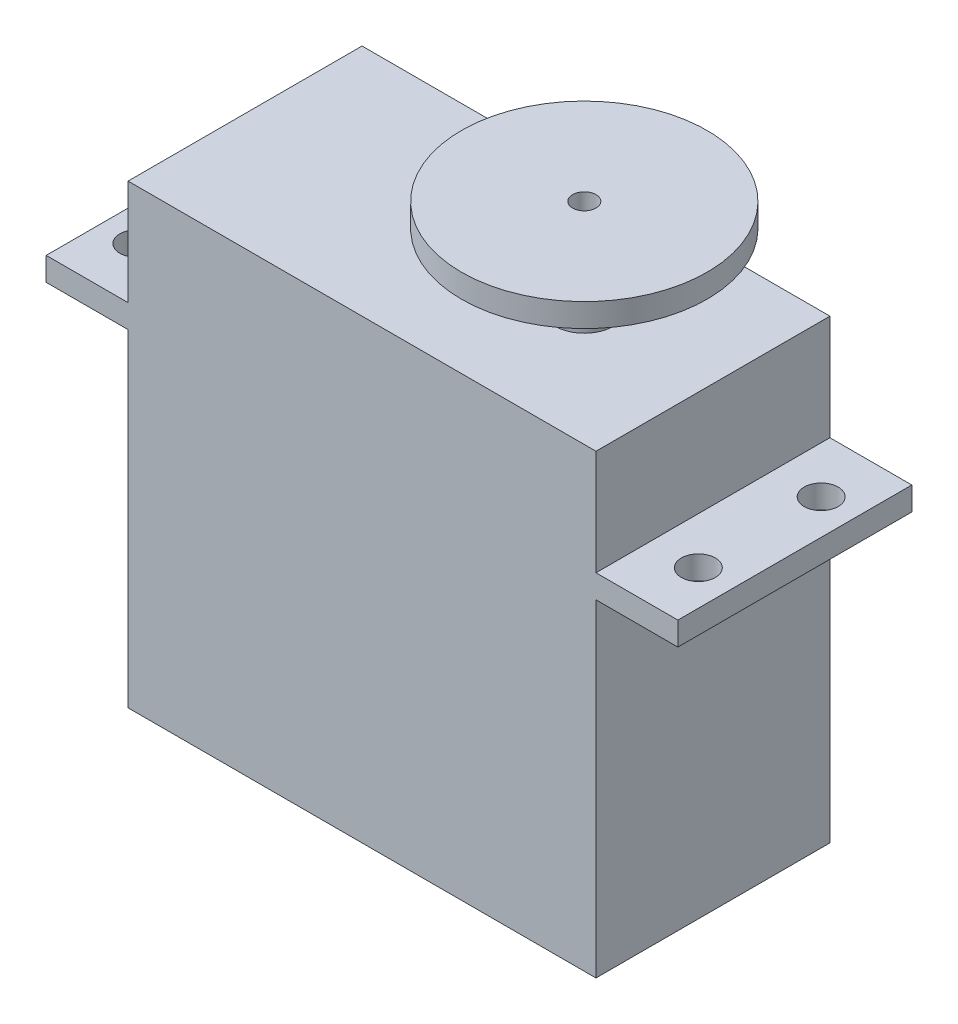
ISO-10303-21;
HEADER;
FILE_DESCRIPTION(('STEP AP214'),'2;1');
FILE_NAME('part.step','',(''),(''),'','','');
FILE_SCHEMA(('AUTOMOTIVE_DESIGN { 1 0 10303 214 1 1 1 1 }'));
ENDSEC;
DATA;
#1=APPLICATION_CONTEXT('core data for automotive mechanical design processes');
#2=APPLICATION_PROTOCOL_DEFINITION('international standard','automotive_design',2000,#1);
#3=PRODUCT_CONTEXT('',#1,'mechanical');
#4=PRODUCT('Part','Part','',(#3));
#5=PRODUCT_RELATED_PRODUCT_CATEGORY('part','',(#4));
#6=PRODUCT_DEFINITION_FORMATION('','',#4);
#7=PRODUCT_DEFINITION_CONTEXT('part definition',#1,'design');
#8=PRODUCT_DEFINITION('design','',#6,#7);
#9=PRODUCT_DEFINITION_SHAPE('','',#8);
#10=(LENGTH_UNIT() NAMED_UNIT(*) SI_UNIT(.MILLI.,.METRE.));
#11=(NAMED_UNIT(*) PLANE_ANGLE_UNIT() SI_UNIT($,.RADIAN.));
#12=(NAMED_UNIT(*) SI_UNIT($,.STERADIAN.) SOLID_ANGLE_UNIT());
#13=UNCERTAINTY_MEASURE_WITH_UNIT(LENGTH_MEASURE(1.E-05),#10,'distance_accuracy_value','');
#14=(GEOMETRIC_REPRESENTATION_CONTEXT(3) GLOBAL_UNCERTAINTY_ASSIGNED_CONTEXT((#13)) GLOBAL_UNIT_ASSIGNED_CONTEXT((#10,
#11,#12)) REPRESENTATION_CONTEXT('',''));
#15=CARTESIAN_POINT('',(0.,0.,0.));
#16=DIRECTION('',(0.,0.,1.));
#17=DIRECTION('',(1.,0.,0.));
#18=AXIS2_PLACEMENT_3D('',#15,#16,#17);
#19=CARTESIAN_POINT('',(-20.,39.,10.));
#20=DIRECTION('',(1.,0.,0.));
#21=DIRECTION('',(0.,0.,-1.));
#22=AXIS2_PLACEMENT_3D('',#19,#20,#21);
#23=PLANE('',#22);
#24=DIRECTION('',(0.,0.,-1.));
#25=VECTOR('',#24,1.);
#26=CARTESIAN_POINT('',(-20.,30.,-10.));
#27=LINE('',#26,#25);
#28=CARTESIAN_POINT('',(-20.,30.,10.));
#29=VERTEX_POINT('',#28);
#30=CARTESIAN_POINT('',(-20.,30.,-10.));
#31=VERTEX_POINT('',#30);
#32=EDGE_CURVE('E151',#29,#31,#27,.T.);
#33=ORIENTED_EDGE('',*,*,#32,.F.);
#34=DIRECTION('',(0.,-1.,0.));
#35=VECTOR('',#34,1.);
#36=CARTESIAN_POINT('',(-20.,39.,10.));
#37=LINE('',#36,#35);
#38=CARTESIAN_POINT('',(-20.,39.,10.));
#39=VERTEX_POINT('',#38);
#40=EDGE_CURVE('E233',#39,#29,#37,.T.);
#41=ORIENTED_EDGE('',*,*,#40,.F.);
#42=DIRECTION('',(0.,0.,1.));
#43=VECTOR('',#42,1.);
#44=CARTESIAN_POINT('',(-20.,39.,10.));
#45=LINE('',#44,#43);
#46=CARTESIAN_POINT('',(-20.,39.,-10.));
#47=VERTEX_POINT('',#46);
#48=EDGE_CURVE('E209',#47,#39,#45,.T.);
#49=ORIENTED_EDGE('',*,*,#48,.F.);
#50=DIRECTION('',(0.,-1.,0.));
#51=VECTOR('',#50,1.);
#52=CARTESIAN_POINT('',(-20.,39.,-10.));
#53=LINE('',#52,#51);
#54=EDGE_CURVE('E63',#47,#31,#53,.T.);
#55=ORIENTED_EDGE('',*,*,#54,.T.);
#56=EDGE_LOOP('',(#33,#41,#49,#55));
#57=FACE_BOUND('',#56,.T.);
#58=ADVANCED_FACE('F39',(#57),#23,.F.);
#59=DIRECTION('',(0.,0.,1.));
#60=VECTOR('',#59,1.);
#61=CARTESIAN_POINT('',(-20.,28.,-10.));
#62=LINE('',#61,#60);
#63=CARTESIAN_POINT('',(-20.,28.,-10.));
#64=VERTEX_POINT('',#63);
#65=CARTESIAN_POINT('',(-20.,28.,10.));
#66=VERTEX_POINT('',#65);
#67=EDGE_CURVE('E55',#64,#66,#62,.T.);
#68=ORIENTED_EDGE('',*,*,#67,.F.);
#69=CARTESIAN_POINT('',(-20.,0.,-10.));
#70=VERTEX_POINT('',#69);
#71=EDGE_CURVE('E155',#64,#70,#53,.T.);
#72=ORIENTED_EDGE('',*,*,#71,.T.);
#73=DIRECTION('',(0.,0.,1.));
#74=VECTOR('',#73,1.);
#75=CARTESIAN_POINT('',(-20.,0.,10.));
#76=LINE('',#75,#74);
#77=CARTESIAN_POINT('',(-20.,0.,10.));
#78=VERTEX_POINT('',#77);
#79=EDGE_CURVE('E222',#70,#78,#76,.T.);
#80=ORIENTED_EDGE('',*,*,#79,.T.);
#81=EDGE_CURVE('E232',#66,#78,#37,.T.);
#82=ORIENTED_EDGE('',*,*,#81,.F.);
#83=EDGE_LOOP('',(#68,#72,#80,#82));
#84=FACE_BOUND('',#83,.T.);
#85=ADVANCED_FACE('F260',(#84),#23,.F.);
#86=CARTESIAN_POINT('',(20.,39.,10.));
#87=DIRECTION('',(-1.,0.,0.));
#88=DIRECTION('',(0.,0.,1.));
#89=AXIS2_PLACEMENT_3D('',#86,#87,#88);
#90=PLANE('',#89);
#91=DIRECTION('',(0.,0.,1.));
#92=VECTOR('',#91,1.);
#93=CARTESIAN_POINT('',(20.,30.,10.));
#94=LINE('',#93,#92);
#95=CARTESIAN_POINT('',(20.,30.,-10.));
#96=VERTEX_POINT('',#95);
#97=CARTESIAN_POINT('',(20.,30.,10.));
#98=VERTEX_POINT('',#97);
#99=EDGE_CURVE('E162',#96,#98,#94,.T.);
#100=ORIENTED_EDGE('',*,*,#99,.F.);
#101=DIRECTION('',(0.,-1.,0.));
#102=VECTOR('',#101,1.);
#103=CARTESIAN_POINT('',(20.,39.,-10.));
#104=LINE('',#103,#102);
#105=CARTESIAN_POINT('',(20.,39.,-10.));
#106=VERTEX_POINT('',#105);
#107=EDGE_CURVE('E48',#106,#96,#104,.T.);
#108=ORIENTED_EDGE('',*,*,#107,.F.);
#109=DIRECTION('',(0.,0.,-1.));
#110=VECTOR('',#109,1.);
#111=CARTESIAN_POINT('',(20.,39.,10.));
#112=LINE('',#111,#110);
#113=CARTESIAN_POINT('',(20.,39.,10.));
#114=VERTEX_POINT('',#113);
#115=EDGE_CURVE('E201',#114,#106,#112,.T.);
#116=ORIENTED_EDGE('',*,*,#115,.F.);
#117=DIRECTION('',(0.,-1.,0.));
#118=VECTOR('',#117,1.);
#119=CARTESIAN_POINT('',(20.,39.,10.));
#120=LINE('',#119,#118);
#121=EDGE_CURVE('E229',#114,#98,#120,.T.);
#122=ORIENTED_EDGE('',*,*,#121,.T.);
#123=EDGE_LOOP('',(#100,#108,#116,#122));
#124=FACE_BOUND('',#123,.T.);
#125=ADVANCED_FACE('F41',(#124),#90,.F.);
#126=DIRECTION('',(0.,0.,-1.));
#127=VECTOR('',#126,1.);
#128=CARTESIAN_POINT('',(20.,28.,10.));
#129=LINE('',#128,#127);
#130=CARTESIAN_POINT('',(20.,28.,10.));
#131=VERTEX_POINT('',#130);
#132=CARTESIAN_POINT('',(20.,28.,-10.));
#133=VERTEX_POINT('',#132);
#134=EDGE_CURVE('E157',#131,#133,#129,.T.);
#135=ORIENTED_EDGE('',*,*,#134,.F.);
#136=CARTESIAN_POINT('',(20.,0.,10.));
#137=VERTEX_POINT('',#136);
#138=EDGE_CURVE('E215',#131,#137,#120,.T.);
#139=ORIENTED_EDGE('',*,*,#138,.T.);
#140=DIRECTION('',(0.,0.,-1.));
#141=VECTOR('',#140,1.);
#142=CARTESIAN_POINT('',(20.,0.,10.));
#143=LINE('',#142,#141);
#144=CARTESIAN_POINT('',(20.,0.,-10.));
#145=VERTEX_POINT('',#144);
#146=EDGE_CURVE('E200',#137,#145,#143,.T.);
#147=ORIENTED_EDGE('',*,*,#146,.T.);
#148=EDGE_CURVE('E238',#133,#145,#104,.T.);
#149=ORIENTED_EDGE('',*,*,#148,.F.);
#150=EDGE_LOOP('',(#135,#139,#147,#149));
#151=FACE_BOUND('',#150,.T.);
#152=ADVANCED_FACE('F253',(#151),#90,.F.);
#153=CARTESIAN_POINT('',(-20.,39.,-10.));
#154=DIRECTION('',(0.,0.,1.));
#155=DIRECTION('',(1.,0.,0.));
#156=AXIS2_PLACEMENT_3D('',#153,#154,#155);
#157=PLANE('',#156);
#158=DIRECTION('',(-1.,0.,0.));
#159=VECTOR('',#158,1.);
#160=CARTESIAN_POINT('',(-20.,0.,-10.));
#161=LINE('',#160,#159);
#162=EDGE_CURVE('E219',#145,#70,#161,.T.);
#163=ORIENTED_EDGE('',*,*,#162,.T.);
#164=ORIENTED_EDGE('',*,*,#71,.F.);
#165=DIRECTION('',(1.,0.,0.));
#166=VECTOR('',#165,1.);
#167=CARTESIAN_POINT('',(-27.,28.,-10.));
#168=LINE('',#167,#166);
#169=CARTESIAN_POINT('',(-27.,28.,-10.));
#170=VERTEX_POINT('',#169);
#171=EDGE_CURVE('E134',#170,#64,#168,.T.);
#172=ORIENTED_EDGE('',*,*,#171,.F.);
#173=DIRECTION('',(0.,-1.,0.));
#174=VECTOR('',#173,1.);
#175=CARTESIAN_POINT('',(-27.,30.,-10.));
#176=LINE('',#175,#174);
#177=CARTESIAN_POINT('',(-27.,30.,-10.));
#178=VERTEX_POINT('',#177);
#179=EDGE_CURVE('E141',#178,#170,#176,.T.);
#180=ORIENTED_EDGE('',*,*,#179,.F.);
#181=DIRECTION('',(1.,0.,0.));
#182=VECTOR('',#181,1.);
#183=CARTESIAN_POINT('',(-27.,30.,-10.));
#184=LINE('',#183,#182);
#185=EDGE_CURVE('E506',#178,#31,#184,.T.);
#186=ORIENTED_EDGE('',*,*,#185,.T.);
#187=ORIENTED_EDGE('',*,*,#54,.F.);
#188=DIRECTION('',(-1.,0.,0.));
#189=VECTOR('',#188,1.);
#190=CARTESIAN_POINT('',(-20.,39.,-10.));
#191=LINE('',#190,#189);
#192=EDGE_CURVE('E205',#106,#47,#191,.T.);
#193=ORIENTED_EDGE('',*,*,#192,.F.);
#194=ORIENTED_EDGE('',*,*,#107,.T.);
#195=DIRECTION('',(-1.,0.,0.));
#196=VECTOR('',#195,1.);
#197=CARTESIAN_POINT('',(27.,30.,-10.));
#198=LINE('',#197,#196);
#199=CARTESIAN_POINT('',(27.,30.,-10.));
#200=VERTEX_POINT('',#199);
#201=EDGE_CURVE('E188',#200,#96,#198,.T.);
#202=ORIENTED_EDGE('',*,*,#201,.F.);
#203=DIRECTION('',(0.,1.,0.));
#204=VECTOR('',#203,1.);
#205=CARTESIAN_POINT('',(27.,30.,-10.));
#206=LINE('',#205,#204);
#207=CARTESIAN_POINT('',(27.,28.,-10.));
#208=VERTEX_POINT('',#207);
#209=EDGE_CURVE('E175',#208,#200,#206,.T.);
#210=ORIENTED_EDGE('',*,*,#209,.F.);
#211=DIRECTION('',(-1.,0.,0.));
#212=VECTOR('',#211,1.);
#213=CARTESIAN_POINT('',(27.,28.,-10.));
#214=LINE('',#213,#212);
#215=EDGE_CURVE('E192',#208,#133,#214,.T.);
#216=ORIENTED_EDGE('',*,*,#215,.T.);
#217=ORIENTED_EDGE('',*,*,#148,.T.);
#218=EDGE_LOOP('',(#163,#164,#172,#180,#186,#187,#193,#194,#202,#210,#216,#217));
#219=FACE_BOUND('',#218,.T.);
#220=ADVANCED_FACE('F154',(#219),#157,.F.);
#221=CARTESIAN_POINT('',(-20.,39.,10.));
#222=DIRECTION('',(0.,0.,-1.));
#223=DIRECTION('',(-1.,0.,0.));
#224=AXIS2_PLACEMENT_3D('',#221,#222,#223);
#225=PLANE('',#224);
#226=DIRECTION('',(1.,0.,0.));
#227=VECTOR('',#226,1.);
#228=CARTESIAN_POINT('',(-20.,0.,10.));
#229=LINE('',#228,#227);
#230=EDGE_CURVE('E206',#78,#137,#229,.T.);
#231=ORIENTED_EDGE('',*,*,#230,.T.);
#232=ORIENTED_EDGE('',*,*,#138,.F.);
#233=DIRECTION('',(-1.,0.,0.));
#234=VECTOR('',#233,1.);
#235=CARTESIAN_POINT('',(27.,28.,10.));
#236=LINE('',#235,#234);
#237=CARTESIAN_POINT('',(27.,28.,10.));
#238=VERTEX_POINT('',#237);
#239=EDGE_CURVE('E196',#238,#131,#236,.T.);
#240=ORIENTED_EDGE('',*,*,#239,.F.);
#241=DIRECTION('',(0.,-1.,0.));
#242=VECTOR('',#241,1.);
#243=CARTESIAN_POINT('',(27.,30.,10.));
#244=LINE('',#243,#242);
#245=CARTESIAN_POINT('',(27.,30.,10.));
#246=VERTEX_POINT('',#245);
#247=EDGE_CURVE('E168',#246,#238,#244,.T.);
#248=ORIENTED_EDGE('',*,*,#247,.F.);
#249=DIRECTION('',(-1.,0.,0.));
#250=VECTOR('',#249,1.);
#251=CARTESIAN_POINT('',(27.,30.,10.));
#252=LINE('',#251,#250);
#253=EDGE_CURVE('E180',#246,#98,#252,.T.);
#254=ORIENTED_EDGE('',*,*,#253,.T.);
#255=ORIENTED_EDGE('',*,*,#121,.F.);
#256=DIRECTION('',(1.,0.,0.));
#257=VECTOR('',#256,1.);
#258=CARTESIAN_POINT('',(-20.,39.,10.));
#259=LINE('',#258,#257);
#260=EDGE_CURVE('E212',#39,#114,#259,.T.);
#261=ORIENTED_EDGE('',*,*,#260,.F.);
#262=ORIENTED_EDGE('',*,*,#40,.T.);
#263=DIRECTION('',(1.,0.,0.));
#264=VECTOR('',#263,1.);
#265=CARTESIAN_POINT('',(-27.,30.,10.));
#266=LINE('',#265,#264);
#267=CARTESIAN_POINT('',(-27.,30.,10.));
#268=VERTEX_POINT('',#267);
#269=EDGE_CURVE('E164',#268,#29,#266,.T.);
#270=ORIENTED_EDGE('',*,*,#269,.F.);
#271=DIRECTION('',(0.,1.,0.));
#272=VECTOR('',#271,1.);
#273=CARTESIAN_POINT('',(-27.,30.,10.));
#274=LINE('',#273,#272);
#275=CARTESIAN_POINT('',(-27.,28.,10.));
#276=VERTEX_POINT('',#275);
#277=EDGE_CURVE('E140',#276,#268,#274,.T.);
#278=ORIENTED_EDGE('',*,*,#277,.F.);
#279=DIRECTION('',(1.,0.,0.));
#280=VECTOR('',#279,1.);
#281=CARTESIAN_POINT('',(-27.,28.,10.));
#282=LINE('',#281,#280);
#283=EDGE_CURVE('E136',#276,#66,#282,.T.);
#284=ORIENTED_EDGE('',*,*,#283,.T.);
#285=ORIENTED_EDGE('',*,*,#81,.T.);
#286=EDGE_LOOP('',(#231,#232,#240,#248,#254,#255,#261,#262,#270,#278,#284,#285));
#287=FACE_BOUND('',#286,.T.);
#288=ADVANCED_FACE('F258',(#287),#225,.F.);
#289=CARTESIAN_POINT('',(0.,39.,0.));
#290=DIRECTION('',(0.,-1.,0.));
#291=DIRECTION('',(0.,0.,-1.));
#292=AXIS2_PLACEMENT_3D('',#289,#290,#291);
#293=PLANE('',#292);
#294=CARTESIAN_POINT('',(9.00000000000001,39.,0.));
#295=DIRECTION('',(0.,-1.,0.));
#296=DIRECTION('',(0.,0.,-1.));
#297=AXIS2_PLACEMENT_3D('',#294,#295,#296);
#298=CIRCLE('',#297,2.5);
#299=CARTESIAN_POINT('',(9.00000000000001,39.,-2.5));
#300=VERTEX_POINT('',#299);
#301=EDGE_CURVE('E11',#300,#300,#298,.F.);
#302=ORIENTED_EDGE('',*,*,#301,.F.);
#303=EDGE_LOOP('',(#302));
#304=FACE_BOUND('',#303,.T.);
#305=ORIENTED_EDGE('',*,*,#115,.T.);
#306=ORIENTED_EDGE('',*,*,#192,.T.);
#307=ORIENTED_EDGE('',*,*,#48,.T.);
#308=ORIENTED_EDGE('',*,*,#260,.T.);
#309=EDGE_LOOP('',(#305,#306,#307,#308));
#310=FACE_BOUND('',#309,.T.);
#311=ADVANCED_FACE('F276',(#304,#310),#293,.F.);
#312=CARTESIAN_POINT('',(0.,0.,0.));
#313=DIRECTION('',(0.,-1.,0.));
#314=DIRECTION('',(0.,0.,-1.));
#315=AXIS2_PLACEMENT_3D('',#312,#313,#314);
#316=PLANE('',#315);
#317=ORIENTED_EDGE('',*,*,#146,.F.);
#318=ORIENTED_EDGE('',*,*,#230,.F.);
#319=ORIENTED_EDGE('',*,*,#79,.F.);
#320=ORIENTED_EDGE('',*,*,#162,.F.);
#321=EDGE_LOOP('',(#317,#318,#319,#320));
#322=FACE_BOUND('',#321,.T.);
#323=ADVANCED_FACE('F251',(#322),#316,.T.);
#324=CARTESIAN_POINT('',(27.,28.,10.));
#325=DIRECTION('',(0.,1.,0.));
#326=DIRECTION('',(0.,0.,1.));
#327=AXIS2_PLACEMENT_3D('',#324,#325,#326);
#328=PLANE('',#327);
#329=CARTESIAN_POINT('',(24.,28.,5.25));
#330=DIRECTION('',(0.,1.,0.));
#331=DIRECTION('',(0.,0.,1.));
#332=AXIS2_PLACEMENT_3D('',#329,#330,#331);
#333=CIRCLE('',#332,1.45);
#334=CARTESIAN_POINT('',(24.,28.,6.7));
#335=VERTEX_POINT('',#334);
#336=EDGE_CURVE('E514',#335,#335,#333,.T.);
#337=ORIENTED_EDGE('',*,*,#336,.T.);
#338=EDGE_LOOP('',(#337));
#339=FACE_BOUND('',#338,.T.);
#340=CARTESIAN_POINT('',(24.,28.,-5.25));
#341=DIRECTION('',(0.,1.,0.));
#342=DIRECTION('',(0.,0.,1.));
#343=AXIS2_PLACEMENT_3D('',#340,#341,#342);
#344=CIRCLE('',#343,1.45);
#345=CARTESIAN_POINT('',(24.,28.,-3.8));
#346=VERTEX_POINT('',#345);
#347=EDGE_CURVE('E522',#346,#346,#344,.T.);
#348=ORIENTED_EDGE('',*,*,#347,.T.);
#349=EDGE_LOOP('',(#348));
#350=FACE_BOUND('',#349,.T.);
#351=ORIENTED_EDGE('',*,*,#134,.T.);
#352=ORIENTED_EDGE('',*,*,#215,.F.);
#353=DIRECTION('',(0.,0.,-1.));
#354=VECTOR('',#353,1.);
#355=CARTESIAN_POINT('',(27.,28.,10.));
#356=LINE('',#355,#354);
#357=EDGE_CURVE('E172',#238,#208,#356,.T.);
#358=ORIENTED_EDGE('',*,*,#357,.F.);
#359=ORIENTED_EDGE('',*,*,#239,.T.);
#360=EDGE_LOOP('',(#351,#352,#358,#359));
#361=FACE_BOUND('',#360,.T.);
#362=ADVANCED_FACE('F293',(#339,#350,#361),#328,.F.);
#363=CARTESIAN_POINT('',(27.,30.,10.));
#364=DIRECTION('',(0.,-1.,0.));
#365=DIRECTION('',(0.,0.,-1.));
#366=AXIS2_PLACEMENT_3D('',#363,#364,#365);
#367=PLANE('',#366);
#368=CARTESIAN_POINT('',(24.,30.,5.25));
#369=DIRECTION('',(0.,1.,0.));
#370=DIRECTION('',(0.,0.,1.));
#371=AXIS2_PLACEMENT_3D('',#368,#369,#370);
#372=CIRCLE('',#371,1.45);
#373=CARTESIAN_POINT('',(24.,30.,6.7));
#374=VERTEX_POINT('',#373);
#375=EDGE_CURVE('E538',#374,#374,#372,.T.);
#376=ORIENTED_EDGE('',*,*,#375,.F.);
#377=EDGE_LOOP('',(#376));
#378=FACE_BOUND('',#377,.T.);
#379=CARTESIAN_POINT('',(24.,30.,-5.25));
#380=DIRECTION('',(0.,1.,0.));
#381=DIRECTION('',(0.,0.,1.));
#382=AXIS2_PLACEMENT_3D('',#379,#380,#381);
#383=CIRCLE('',#382,1.45);
#384=CARTESIAN_POINT('',(24.,30.,-3.8));
#385=VERTEX_POINT('',#384);
#386=EDGE_CURVE('E534',#385,#385,#383,.T.);
#387=ORIENTED_EDGE('',*,*,#386,.F.);
#388=EDGE_LOOP('',(#387));
#389=FACE_BOUND('',#388,.T.);
#390=ORIENTED_EDGE('',*,*,#99,.T.);
#391=ORIENTED_EDGE('',*,*,#253,.F.);
#392=DIRECTION('',(0.,0.,1.));
#393=VECTOR('',#392,1.);
#394=CARTESIAN_POINT('',(27.,30.,10.));
#395=LINE('',#394,#393);
#396=EDGE_CURVE('E178',#200,#246,#395,.T.);
#397=ORIENTED_EDGE('',*,*,#396,.F.);
#398=ORIENTED_EDGE('',*,*,#201,.T.);
#399=EDGE_LOOP('',(#390,#391,#397,#398));
#400=FACE_BOUND('',#399,.T.);
#401=ADVANCED_FACE('F305',(#378,#389,#400),#367,.F.);
#402=CARTESIAN_POINT('',(27.,0.,0.));
#403=DIRECTION('',(1.,0.,0.));
#404=DIRECTION('',(0.,0.,-1.));
#405=AXIS2_PLACEMENT_3D('',#402,#403,#404);
#406=PLANE('',#405);
#407=ORIENTED_EDGE('',*,*,#247,.T.);
#408=ORIENTED_EDGE('',*,*,#357,.T.);
#409=ORIENTED_EDGE('',*,*,#209,.T.);
#410=ORIENTED_EDGE('',*,*,#396,.T.);
#411=EDGE_LOOP('',(#407,#408,#409,#410));
#412=FACE_BOUND('',#411,.T.);
#413=ADVANCED_FACE('F314',(#412),#406,.T.);
#414=CARTESIAN_POINT('',(-27.,28.,-10.));
#415=DIRECTION('',(0.,1.,0.));
#416=DIRECTION('',(0.,0.,1.));
#417=AXIS2_PLACEMENT_3D('',#414,#415,#416);
#418=PLANE('',#417);
#419=CARTESIAN_POINT('',(-24.,28.,-5.25));
#420=DIRECTION('',(0.,1.,0.));
#421=DIRECTION('',(0.,0.,1.));
#422=AXIS2_PLACEMENT_3D('',#419,#420,#421);
#423=CIRCLE('',#422,1.45);
#424=CARTESIAN_POINT('',(-24.,28.,-3.8));
#425=VERTEX_POINT('',#424);
#426=EDGE_CURVE('E526',#425,#425,#423,.T.);
#427=ORIENTED_EDGE('',*,*,#426,.T.);
#428=EDGE_LOOP('',(#427));
#429=FACE_BOUND('',#428,.T.);
#430=CARTESIAN_POINT('',(-24.,28.,5.25));
#431=DIRECTION('',(0.,1.,0.));
#432=DIRECTION('',(0.,0.,1.));
#433=AXIS2_PLACEMENT_3D('',#430,#431,#432);
#434=CIRCLE('',#433,1.45);
#435=CARTESIAN_POINT('',(-24.,28.,6.7));
#436=VERTEX_POINT('',#435);
#437=EDGE_CURVE('E530',#436,#436,#434,.T.);
#438=ORIENTED_EDGE('',*,*,#437,.T.);
#439=EDGE_LOOP('',(#438));
#440=FACE_BOUND('',#439,.T.);
#441=ORIENTED_EDGE('',*,*,#67,.T.);
#442=ORIENTED_EDGE('',*,*,#283,.F.);
#443=DIRECTION('',(0.,0.,1.));
#444=VECTOR('',#443,1.);
#445=CARTESIAN_POINT('',(-27.,28.,-10.));
#446=LINE('',#445,#444);
#447=EDGE_CURVE('E130',#170,#276,#446,.T.);
#448=ORIENTED_EDGE('',*,*,#447,.F.);
#449=ORIENTED_EDGE('',*,*,#171,.T.);
#450=EDGE_LOOP('',(#441,#442,#448,#449));
#451=FACE_BOUND('',#450,.T.);
#452=ADVANCED_FACE('F132',(#429,#440,#451),#418,.F.);
#453=CARTESIAN_POINT('',(-27.,30.,-10.));
#454=DIRECTION('',(0.,-1.,0.));
#455=DIRECTION('',(0.,0.,-1.));
#456=AXIS2_PLACEMENT_3D('',#453,#454,#455);
#457=PLANE('',#456);
#458=CARTESIAN_POINT('',(-24.,30.,-5.25));
#459=DIRECTION('',(0.,1.,0.));
#460=DIRECTION('',(0.,0.,1.));
#461=AXIS2_PLACEMENT_3D('',#458,#459,#460);
#462=CIRCLE('',#461,1.45);
#463=CARTESIAN_POINT('',(-24.,30.,-3.8));
#464=VERTEX_POINT('',#463);
#465=EDGE_CURVE('E539',#464,#464,#462,.T.);
#466=ORIENTED_EDGE('',*,*,#465,.F.);
#467=EDGE_LOOP('',(#466));
#468=FACE_BOUND('',#467,.T.);
#469=CARTESIAN_POINT('',(-24.,30.,5.25));
#470=DIRECTION('',(0.,1.,0.));
#471=DIRECTION('',(0.,0.,1.));
#472=AXIS2_PLACEMENT_3D('',#469,#470,#471);
#473=CIRCLE('',#472,1.45);
#474=CARTESIAN_POINT('',(-24.,30.,6.7));
#475=VERTEX_POINT('',#474);
#476=EDGE_CURVE('E543',#475,#475,#473,.T.);
#477=ORIENTED_EDGE('',*,*,#476,.F.);
#478=EDGE_LOOP('',(#477));
#479=FACE_BOUND('',#478,.T.);
#480=ORIENTED_EDGE('',*,*,#32,.T.);
#481=ORIENTED_EDGE('',*,*,#185,.F.);
#482=DIRECTION('',(0.,0.,-1.));
#483=VECTOR('',#482,1.);
#484=CARTESIAN_POINT('',(-27.,30.,-10.));
#485=LINE('',#484,#483);
#486=EDGE_CURVE('E146',#268,#178,#485,.T.);
#487=ORIENTED_EDGE('',*,*,#486,.F.);
#488=ORIENTED_EDGE('',*,*,#269,.T.);
#489=EDGE_LOOP('',(#480,#481,#487,#488));
#490=FACE_BOUND('',#489,.T.);
#491=ADVANCED_FACE('F329',(#468,#479,#490),#457,.F.);
#492=CARTESIAN_POINT('',(-27.,0.,0.));
#493=DIRECTION('',(-1.,0.,0.));
#494=DIRECTION('',(0.,0.,1.));
#495=AXIS2_PLACEMENT_3D('',#492,#493,#494);
#496=PLANE('',#495);
#497=ORIENTED_EDGE('',*,*,#179,.T.);
#498=ORIENTED_EDGE('',*,*,#447,.T.);
#499=ORIENTED_EDGE('',*,*,#277,.T.);
#500=ORIENTED_EDGE('',*,*,#486,.T.);
#501=EDGE_LOOP('',(#497,#498,#499,#500));
#502=FACE_BOUND('',#501,.T.);
#503=ADVANCED_FACE('F144',(#502),#496,.T.);
#504=CARTESIAN_POINT('',(-24.,0.,5.25));
#505=DIRECTION('',(0.,1.,0.));
#506=DIRECTION('',(0.,0.,1.));
#507=AXIS2_PLACEMENT_3D('',#504,#505,#506);
#508=CYLINDRICAL_SURFACE('',#507,1.45);
#509=ORIENTED_EDGE('',*,*,#476,.T.);
#510=EDGE_LOOP('',(#509));
#511=FACE_BOUND('',#510,.T.);
#512=ORIENTED_EDGE('',*,*,#437,.F.);
#513=EDGE_LOOP('',(#512));
#514=FACE_BOUND('',#513,.T.);
#515=ADVANCED_FACE('F344',(#511,#514),#508,.F.);
#516=CARTESIAN_POINT('',(-24.,0.,-5.25));
#517=DIRECTION('',(0.,1.,0.));
#518=DIRECTION('',(0.,0.,1.));
#519=AXIS2_PLACEMENT_3D('',#516,#517,#518);
#520=CYLINDRICAL_SURFACE('',#519,1.45);
#521=ORIENTED_EDGE('',*,*,#465,.T.);
#522=EDGE_LOOP('',(#521));
#523=FACE_BOUND('',#522,.T.);
#524=ORIENTED_EDGE('',*,*,#426,.F.);
#525=EDGE_LOOP('',(#524));
#526=FACE_BOUND('',#525,.T.);
#527=ADVANCED_FACE('F351',(#523,#526),#520,.F.);
#528=CARTESIAN_POINT('',(24.,0.,-5.25));
#529=DIRECTION('',(0.,1.,0.));
#530=DIRECTION('',(0.,0.,1.));
#531=AXIS2_PLACEMENT_3D('',#528,#529,#530);
#532=CYLINDRICAL_SURFACE('',#531,1.45);
#533=ORIENTED_EDGE('',*,*,#386,.T.);
#534=EDGE_LOOP('',(#533));
#535=FACE_BOUND('',#534,.T.);
#536=ORIENTED_EDGE('',*,*,#347,.F.);
#537=EDGE_LOOP('',(#536));
#538=FACE_BOUND('',#537,.T.);
#539=ADVANCED_FACE('F359',(#535,#538),#532,.F.);
#540=CARTESIAN_POINT('',(24.,0.,5.25));
#541=DIRECTION('',(0.,1.,0.));
#542=DIRECTION('',(0.,0.,1.));
#543=AXIS2_PLACEMENT_3D('',#540,#541,#542);
#544=CYLINDRICAL_SURFACE('',#543,1.45);
#545=ORIENTED_EDGE('',*,*,#375,.T.);
#546=EDGE_LOOP('',(#545));
#547=FACE_BOUND('',#546,.T.);
#548=ORIENTED_EDGE('',*,*,#336,.F.);
#549=EDGE_LOOP('',(#548));
#550=FACE_BOUND('',#549,.T.);
#551=ADVANCED_FACE('F367',(#547,#550),#544,.F.);
#552=CARTESIAN_POINT('',(9.00000000000001,45.,0.));
#553=DIRECTION('',(0.,-1.,0.));
#554=DIRECTION('',(0.,0.,-1.));
#555=AXIS2_PLACEMENT_3D('',#552,#553,#554);
#556=CYLINDRICAL_SURFACE('',#555,2.5);
#557=CARTESIAN_POINT('',(9.00000000000001,45.,0.));
#558=DIRECTION('',(0.,1.,0.));
#559=DIRECTION('',(0.,0.,1.));
#560=AXIS2_PLACEMENT_3D('',#557,#558,#559);
#561=CIRCLE('',#560,2.5);
#562=CARTESIAN_POINT('',(9.00000000000001,45.,2.5));
#563=VERTEX_POINT('',#562);
#564=EDGE_CURVE('E550',#563,#563,#561,.T.);
#565=ORIENTED_EDGE('',*,*,#564,.F.);
#566=EDGE_LOOP('',(#565));
#567=FACE_BOUND('',#566,.T.);
#568=ORIENTED_EDGE('',*,*,#301,.T.);
#569=EDGE_LOOP('',(#568));
#570=FACE_BOUND('',#569,.T.);
#571=ADVANCED_FACE('F375',(#567,#570),#556,.T.);
#572=CARTESIAN_POINT('',(9.00000000000001,47.,0.));
#573=DIRECTION('',(0.,-1.,0.));
#574=DIRECTION('',(0.,0.,-1.));
#575=AXIS2_PLACEMENT_3D('',#572,#573,#574);
#576=CYLINDRICAL_SURFACE('',#575,10.5);
#577=CARTESIAN_POINT('',(9.00000000000001,47.,0.));
#578=DIRECTION('',(0.,1.,0.));
#579=DIRECTION('',(0.,0.,1.));
#580=AXIS2_PLACEMENT_3D('',#577,#578,#579);
#581=CIRCLE('',#580,10.5);
#582=CARTESIAN_POINT('',(9.00000000000001,47.,10.5));
#583=VERTEX_POINT('',#582);
#584=EDGE_CURVE('E554',#583,#583,#581,.T.);
#585=ORIENTED_EDGE('',*,*,#584,.F.);
#586=EDGE_LOOP('',(#585));
#587=FACE_BOUND('',#586,.T.);
#588=CARTESIAN_POINT('',(9.00000000000001,45.,0.));
#589=DIRECTION('',(0.,1.,0.));
#590=DIRECTION('',(0.,0.,1.));
#591=AXIS2_PLACEMENT_3D('',#588,#589,#590);
#592=CIRCLE('',#591,10.5);
#593=CARTESIAN_POINT('',(9.00000000000001,45.,10.5));
#594=VERTEX_POINT('',#593);
#595=EDGE_CURVE('E555',#594,#594,#592,.T.);
#596=ORIENTED_EDGE('',*,*,#595,.T.);
#597=EDGE_LOOP('',(#596));
#598=FACE_BOUND('',#597,.T.);
#599=ADVANCED_FACE('F383',(#587,#598),#576,.T.);
#600=CARTESIAN_POINT('',(9.00000000000001,47.,0.));
#601=DIRECTION('',(0.,1.,0.));
#602=DIRECTION('',(0.,0.,1.));
#603=AXIS2_PLACEMENT_3D('',#600,#601,#602);
#604=PLANE('',#603);
#605=CARTESIAN_POINT('',(9.00000000000001,47.,0.));
#606=DIRECTION('',(0.,1.,0.));
#607=DIRECTION('',(0.,0.,1.));
#608=AXIS2_PLACEMENT_3D('',#605,#606,#607);
#609=CIRCLE('',#608,1.);
#610=CARTESIAN_POINT('',(9.00000000000001,47.,1.));
#611=VERTEX_POINT('',#610);
#612=EDGE_CURVE('E563',#611,#611,#609,.T.);
#613=ORIENTED_EDGE('',*,*,#612,.F.);
#614=EDGE_LOOP('',(#613));
#615=FACE_BOUND('',#614,.T.);
#616=ORIENTED_EDGE('',*,*,#584,.T.);
#617=EDGE_LOOP('',(#616));
#618=FACE_BOUND('',#617,.T.);
#619=ADVANCED_FACE('F391',(#615,#618),#604,.T.);
#620=CARTESIAN_POINT('',(9.00000000000001,45.,0.));
#621=DIRECTION('',(0.,1.,0.));
#622=DIRECTION('',(0.,0.,1.));
#623=AXIS2_PLACEMENT_3D('',#620,#621,#622);
#624=PLANE('',#623);
#625=ORIENTED_EDGE('',*,*,#564,.T.);
#626=EDGE_LOOP('',(#625));
#627=FACE_BOUND('',#626,.T.);
#628=ORIENTED_EDGE('',*,*,#595,.F.);
#629=EDGE_LOOP('',(#628));
#630=FACE_BOUND('',#629,.T.);
#631=ADVANCED_FACE('F400',(#627,#630),#624,.F.);
#632=CARTESIAN_POINT('',(9.00000000000001,41.,0.));
#633=DIRECTION('',(0.,1.,0.));
#634=DIRECTION('',(0.,0.,1.));
#635=AXIS2_PLACEMENT_3D('',#632,#633,#634);
#636=CYLINDRICAL_SURFACE('',#635,1.);
#637=CARTESIAN_POINT('',(9.00000000000001,41.,0.));
#638=DIRECTION('',(0.,1.,0.));
#639=DIRECTION('',(0.,0.,1.));
#640=AXIS2_PLACEMENT_3D('',#637,#638,#639);
#641=CIRCLE('',#640,1.);
#642=CARTESIAN_POINT('',(9.00000000000001,41.,1.));
#643=VERTEX_POINT('',#642);
#644=EDGE_CURVE('E559',#643,#643,#641,.T.);
#645=ORIENTED_EDGE('',*,*,#644,.F.);
#646=EDGE_LOOP('',(#645));
#647=FACE_BOUND('',#646,.T.);
#648=ORIENTED_EDGE('',*,*,#612,.T.);
#649=EDGE_LOOP('',(#648));
#650=FACE_BOUND('',#649,.T.);
#651=ADVANCED_FACE('F408',(#647,#650),#636,.F.);
#652=CARTESIAN_POINT('',(9.00000000000001,41.,0.));
#653=DIRECTION('',(0.,1.,0.));
#654=DIRECTION('',(0.,0.,1.));
#655=AXIS2_PLACEMENT_3D('',#652,#653,#654);
#656=PLANE('',#655);
#657=ORIENTED_EDGE('',*,*,#644,.T.);
#658=EDGE_LOOP('',(#657));
#659=FACE_BOUND('',#658,.T.);
#660=ADVANCED_FACE('F415',(#659),#656,.T.);
#661=CLOSED_SHELL('',(#58,#85,#125,#152,#220,#288,#311,#323,#362,#401,#413,#452,#491,#503,#515,
#527,#539,#551,#571,#599,#619,#631,#651,#660));
#662=MANIFOLD_SOLID_BREP('B2',#661);
#663=ADVANCED_BREP_SHAPE_REPRESENTATION('',(#18,#662),#14);
#664=SHAPE_DEFINITION_REPRESENTATION(#9,#663);
ENDSEC;
END-ISO-10303-21;
